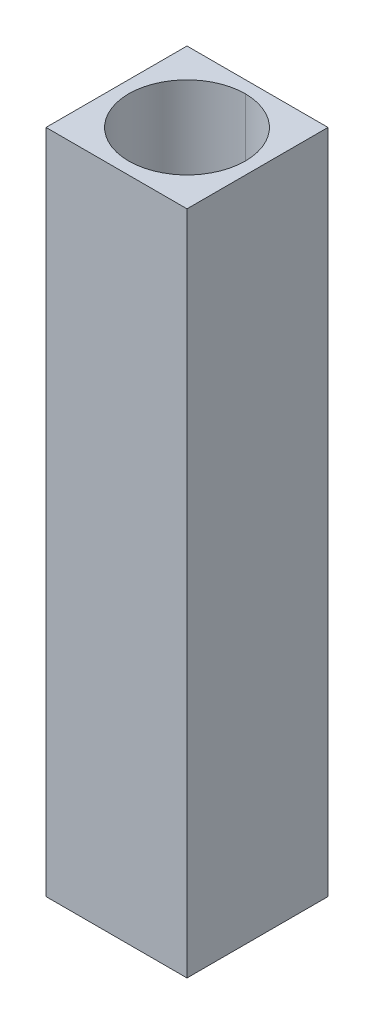
ISO-10303-21;
HEADER;
FILE_DESCRIPTION(('STEP AP214'),'2;1');
FILE_NAME('part.step','',(''),(''),'','','');
FILE_SCHEMA(('AUTOMOTIVE_DESIGN { 1 0 10303 214 1 1 1 1 }'));
ENDSEC;
DATA;
#1=APPLICATION_CONTEXT('core data for automotive mechanical design processes');
#2=APPLICATION_PROTOCOL_DEFINITION('international standard','automotive_design',2000,#1);
#3=PRODUCT_CONTEXT('',#1,'mechanical');
#4=PRODUCT('Part','Part','',(#3));
#5=PRODUCT_RELATED_PRODUCT_CATEGORY('part','',(#4));
#6=PRODUCT_DEFINITION_FORMATION('','',#4);
#7=PRODUCT_DEFINITION_CONTEXT('part definition',#1,'design');
#8=PRODUCT_DEFINITION('design','',#6,#7);
#9=PRODUCT_DEFINITION_SHAPE('','',#8);
#10=(LENGTH_UNIT() NAMED_UNIT(*) SI_UNIT(.MILLI.,.METRE.));
#11=(NAMED_UNIT(*) PLANE_ANGLE_UNIT() SI_UNIT($,.RADIAN.));
#12=(NAMED_UNIT(*) SI_UNIT($,.STERADIAN.) SOLID_ANGLE_UNIT());
#13=UNCERTAINTY_MEASURE_WITH_UNIT(LENGTH_MEASURE(1.E-05),#10,'distance_accuracy_value','');
#14=(GEOMETRIC_REPRESENTATION_CONTEXT(3) GLOBAL_UNCERTAINTY_ASSIGNED_CONTEXT((#13)) GLOBAL_UNIT_ASSIGNED_CONTEXT((#10,
#11,#12)) REPRESENTATION_CONTEXT('',''));
#15=CARTESIAN_POINT('',(0.,0.,0.));
#16=DIRECTION('',(0.,0.,1.));
#17=DIRECTION('',(1.,0.,0.));
#18=AXIS2_PLACEMENT_3D('',#15,#16,#17);
#19=CARTESIAN_POINT('',(0.,0.,0.));
#20=DIRECTION('',(0.,1.,0.));
#21=DIRECTION('',(0.,0.,1.));
#22=AXIS2_PLACEMENT_3D('',#19,#20,#21);
#23=CYLINDRICAL_SURFACE('',#22,0.525);
#24=CARTESIAN_POINT('',(0.,0.,0.));
#25=DIRECTION('',(0.,1.,0.));
#26=DIRECTION('',(0.,0.,1.));
#27=AXIS2_PLACEMENT_3D('',#24,#25,#26);
#28=CIRCLE('',#27,0.525);
#29=CARTESIAN_POINT('',(0.,0.,-0.525));
#30=VERTEX_POINT('',#29);
#31=CARTESIAN_POINT('',(0.,0.,0.525));
#32=VERTEX_POINT('',#31);
#33=EDGE_CURVE('E13',#30,#32,#28,.T.);
#34=ORIENTED_EDGE('',*,*,#33,.F.);
#35=DIRECTION('',(0.,1.,0.));
#36=VECTOR('',#35,1.);
#37=CARTESIAN_POINT('',(0.,0.,-0.525));
#38=LINE('',#37,#36);
#39=CARTESIAN_POINT('',(0.,6.,-0.525));
#40=VERTEX_POINT('',#39);
#41=EDGE_CURVE('E32',#30,#40,#38,.T.);
#42=ORIENTED_EDGE('',*,*,#41,.T.);
#43=CARTESIAN_POINT('',(0.,6.,0.));
#44=DIRECTION('',(0.,1.,0.));
#45=DIRECTION('',(0.,0.,1.));
#46=AXIS2_PLACEMENT_3D('',#43,#44,#45);
#47=CIRCLE('',#46,0.525);
#48=CARTESIAN_POINT('',(0.,6.,0.525));
#49=VERTEX_POINT('',#48);
#50=EDGE_CURVE('E122',#40,#49,#47,.T.);
#51=ORIENTED_EDGE('',*,*,#50,.T.);
#52=DIRECTION('',(0.,1.,0.));
#53=VECTOR('',#52,1.);
#54=CARTESIAN_POINT('',(0.,0.,0.525));
#55=LINE('',#54,#53);
#56=EDGE_CURVE('E45',#32,#49,#55,.T.);
#57=ORIENTED_EDGE('',*,*,#56,.F.);
#58=EDGE_LOOP('',(#34,#42,#51,#57));
#59=FACE_BOUND('',#58,.T.);
#60=ADVANCED_FACE('F25',(#59),#23,.F.);
#61=CARTESIAN_POINT('',(1.385,6.,1.385));
#62=DIRECTION('',(0.,1.,0.));
#63=DIRECTION('',(0.,0.,1.));
#64=AXIS2_PLACEMENT_3D('',#61,#62,#63);
#65=PLANE('',#64);
#66=CARTESIAN_POINT('',(0.,6.,0.));
#67=DIRECTION('',(0.,1.,0.));
#68=DIRECTION('',(0.,0.,1.));
#69=AXIS2_PLACEMENT_3D('',#66,#67,#68);
#70=CIRCLE('',#69,0.525);
#71=EDGE_CURVE('E119',#49,#40,#70,.T.);
#72=ORIENTED_EDGE('',*,*,#71,.F.);
#73=ORIENTED_EDGE('',*,*,#50,.F.);
#74=EDGE_LOOP('',(#72,#73));
#75=FACE_BOUND('',#74,.T.);
#76=DIRECTION('',(-1.,0.,0.));
#77=VECTOR('',#76,1.);
#78=CARTESIAN_POINT('',(-0.635000000000001,6.,-0.635000000000001));
#79=LINE('',#78,#77);
#80=CARTESIAN_POINT('',(0.634999999999998,6.,-0.635000000000001));
#81=VERTEX_POINT('',#80);
#82=CARTESIAN_POINT('',(-0.635000000000001,6.,-0.635000000000001));
#83=VERTEX_POINT('',#82);
#84=EDGE_CURVE('E117',#81,#83,#79,.T.);
#85=ORIENTED_EDGE('',*,*,#84,.T.);
#86=DIRECTION('',(0.,0.,1.));
#87=VECTOR('',#86,1.);
#88=CARTESIAN_POINT('',(-0.635000000000001,6.,-0.635000000000001));
#89=LINE('',#88,#87);
#90=CARTESIAN_POINT('',(-0.635000000000001,6.,0.635000000000001));
#91=VERTEX_POINT('',#90);
#92=EDGE_CURVE('E115',#83,#91,#89,.T.);
#93=ORIENTED_EDGE('',*,*,#92,.T.);
#94=DIRECTION('',(1.,0.,0.));
#95=VECTOR('',#94,1.);
#96=CARTESIAN_POINT('',(-0.635000000000001,6.,0.635000000000001));
#97=LINE('',#96,#95);
#98=CARTESIAN_POINT('',(0.634999999999998,6.,0.635000000000001));
#99=VERTEX_POINT('',#98);
#100=EDGE_CURVE('E113',#91,#99,#97,.T.);
#101=ORIENTED_EDGE('',*,*,#100,.T.);
#102=DIRECTION('',(0.,0.,-1.));
#103=VECTOR('',#102,1.);
#104=CARTESIAN_POINT('',(0.634999999999998,6.,-0.635000000000001));
#105=LINE('',#104,#103);
#106=EDGE_CURVE('E100',#99,#81,#105,.T.);
#107=ORIENTED_EDGE('',*,*,#106,.T.);
#108=EDGE_LOOP('',(#85,#93,#101,#107));
#109=FACE_BOUND('',#108,.T.);
#110=ADVANCED_FACE('F126',(#75,#109),#65,.T.);
#111=CARTESIAN_POINT('',(0.,0.,0.));
#112=DIRECTION('',(0.,1.,0.));
#113=DIRECTION('',(0.,0.,1.));
#114=AXIS2_PLACEMENT_3D('',#111,#112,#113);
#115=CYLINDRICAL_SURFACE('',#114,0.525);
#116=ORIENTED_EDGE('',*,*,#41,.F.);
#117=CARTESIAN_POINT('',(0.,0.,0.));
#118=DIRECTION('',(0.,1.,0.));
#119=DIRECTION('',(0.,0.,1.));
#120=AXIS2_PLACEMENT_3D('',#117,#118,#119);
#121=CIRCLE('',#120,0.525);
#122=EDGE_CURVE('E109',#32,#30,#121,.T.);
#123=ORIENTED_EDGE('',*,*,#122,.F.);
#124=ORIENTED_EDGE('',*,*,#56,.T.);
#125=ORIENTED_EDGE('',*,*,#71,.T.);
#126=EDGE_LOOP('',(#116,#123,#124,#125));
#127=FACE_BOUND('',#126,.T.);
#128=ADVANCED_FACE('F124',(#127),#115,.F.);
#129=CARTESIAN_POINT('',(1.385,0.,1.385));
#130=DIRECTION('',(0.,1.,0.));
#131=DIRECTION('',(0.,0.,1.));
#132=AXIS2_PLACEMENT_3D('',#129,#130,#131);
#133=PLANE('',#132);
#134=ORIENTED_EDGE('',*,*,#122,.T.);
#135=ORIENTED_EDGE('',*,*,#33,.T.);
#136=EDGE_LOOP('',(#134,#135));
#137=FACE_BOUND('',#136,.T.);
#138=DIRECTION('',(0.,0.,1.));
#139=VECTOR('',#138,1.);
#140=CARTESIAN_POINT('',(-0.635000000000001,0.,1.385));
#141=LINE('',#140,#139);
#142=CARTESIAN_POINT('',(-0.635000000000001,0.,-0.635000000000001));
#143=VERTEX_POINT('',#142);
#144=CARTESIAN_POINT('',(-0.635000000000001,0.,0.635000000000001));
#145=VERTEX_POINT('',#144);
#146=EDGE_CURVE('E107',#143,#145,#141,.T.);
#147=ORIENTED_EDGE('',*,*,#146,.F.);
#148=DIRECTION('',(-1.,0.,0.));
#149=VECTOR('',#148,1.);
#150=CARTESIAN_POINT('',(1.385,0.,-0.635000000000001));
#151=LINE('',#150,#149);
#152=CARTESIAN_POINT('',(0.634999999999998,0.,-0.635000000000001));
#153=VERTEX_POINT('',#152);
#154=EDGE_CURVE('E83',#153,#143,#151,.T.);
#155=ORIENTED_EDGE('',*,*,#154,.F.);
#156=DIRECTION('',(0.,0.,-1.));
#157=VECTOR('',#156,1.);
#158=CARTESIAN_POINT('',(0.634999999999998,0.,1.385));
#159=LINE('',#158,#157);
#160=CARTESIAN_POINT('',(0.634999999999998,0.,0.635000000000001));
#161=VERTEX_POINT('',#160);
#162=EDGE_CURVE('E77',#161,#153,#159,.T.);
#163=ORIENTED_EDGE('',*,*,#162,.F.);
#164=DIRECTION('',(1.,0.,0.));
#165=VECTOR('',#164,1.);
#166=CARTESIAN_POINT('',(1.385,0.,0.635000000000001));
#167=LINE('',#166,#165);
#168=EDGE_CURVE('E80',#145,#161,#167,.T.);
#169=ORIENTED_EDGE('',*,*,#168,.F.);
#170=EDGE_LOOP('',(#147,#155,#163,#169));
#171=FACE_BOUND('',#170,.T.);
#172=ADVANCED_FACE('F79',(#137,#171),#133,.F.);
#173=CARTESIAN_POINT('',(-0.635000000000001,-4.,0.635000000000001));
#174=DIRECTION('',(0.,0.,1.));
#175=DIRECTION('',(1.,0.,0.));
#176=AXIS2_PLACEMENT_3D('',#173,#174,#175);
#177=PLANE('',#176);
#178=ORIENTED_EDGE('',*,*,#168,.T.);
#179=DIRECTION('',(0.,1.,0.));
#180=VECTOR('',#179,1.);
#181=CARTESIAN_POINT('',(0.634999999999998,-4.,0.635000000000001));
#182=LINE('',#181,#180);
#183=EDGE_CURVE('E93',#161,#99,#182,.T.);
#184=ORIENTED_EDGE('',*,*,#183,.T.);
#185=ORIENTED_EDGE('',*,*,#100,.F.);
#186=DIRECTION('',(0.,1.,0.));
#187=VECTOR('',#186,1.);
#188=CARTESIAN_POINT('',(-0.635000000000001,-4.,0.635000000000001));
#189=LINE('',#188,#187);
#190=EDGE_CURVE('E95',#145,#91,#189,.T.);
#191=ORIENTED_EDGE('',*,*,#190,.F.);
#192=EDGE_LOOP('',(#178,#184,#185,#191));
#193=FACE_BOUND('',#192,.T.);
#194=ADVANCED_FACE('F91',(#193),#177,.T.);
#195=CARTESIAN_POINT('',(0.634999999999998,-4.,-0.635000000000001));
#196=DIRECTION('',(1.,0.,0.));
#197=DIRECTION('',(0.,0.,-1.));
#198=AXIS2_PLACEMENT_3D('',#195,#196,#197);
#199=PLANE('',#198);
#200=ORIENTED_EDGE('',*,*,#162,.T.);
#201=DIRECTION('',(0.,1.,0.));
#202=VECTOR('',#201,1.);
#203=CARTESIAN_POINT('',(0.634999999999998,-4.,-0.635000000000001));
#204=LINE('',#203,#202);
#205=EDGE_CURVE('E102',#153,#81,#204,.T.);
#206=ORIENTED_EDGE('',*,*,#205,.T.);
#207=ORIENTED_EDGE('',*,*,#106,.F.);
#208=ORIENTED_EDGE('',*,*,#183,.F.);
#209=EDGE_LOOP('',(#200,#206,#207,#208));
#210=FACE_BOUND('',#209,.T.);
#211=ADVANCED_FACE('F98',(#210),#199,.T.);
#212=CARTESIAN_POINT('',(-0.635000000000001,-4.,-0.635000000000001));
#213=DIRECTION('',(0.,0.,-1.));
#214=DIRECTION('',(-1.,0.,0.));
#215=AXIS2_PLACEMENT_3D('',#212,#213,#214);
#216=PLANE('',#215);
#217=ORIENTED_EDGE('',*,*,#154,.T.);
#218=DIRECTION('',(0.,1.,0.));
#219=VECTOR('',#218,1.);
#220=CARTESIAN_POINT('',(-0.635000000000001,-4.,-0.635000000000001));
#221=LINE('',#220,#219);
#222=EDGE_CURVE('E135',#143,#83,#221,.T.);
#223=ORIENTED_EDGE('',*,*,#222,.T.);
#224=ORIENTED_EDGE('',*,*,#84,.F.);
#225=ORIENTED_EDGE('',*,*,#205,.F.);
#226=EDGE_LOOP('',(#217,#223,#224,#225));
#227=FACE_BOUND('',#226,.T.);
#228=ADVANCED_FACE('F136',(#227),#216,.T.);
#229=CARTESIAN_POINT('',(-0.635000000000001,-4.,-0.635000000000001));
#230=DIRECTION('',(-1.,0.,0.));
#231=DIRECTION('',(0.,0.,1.));
#232=AXIS2_PLACEMENT_3D('',#229,#230,#231);
#233=PLANE('',#232);
#234=ORIENTED_EDGE('',*,*,#146,.T.);
#235=ORIENTED_EDGE('',*,*,#190,.T.);
#236=ORIENTED_EDGE('',*,*,#92,.F.);
#237=ORIENTED_EDGE('',*,*,#222,.F.);
#238=EDGE_LOOP('',(#234,#235,#236,#237));
#239=FACE_BOUND('',#238,.T.);
#240=ADVANCED_FACE('F134',(#239),#233,.T.);
#241=CLOSED_SHELL('',(#60,#110,#128,#172,#194,#211,#228,#240));
#242=MANIFOLD_SOLID_BREP('B1',#241);
#243=ADVANCED_BREP_SHAPE_REPRESENTATION('',(#18,#242),#14);
#244=SHAPE_DEFINITION_REPRESENTATION(#9,#243);
ENDSEC;
END-ISO-10303-21;
